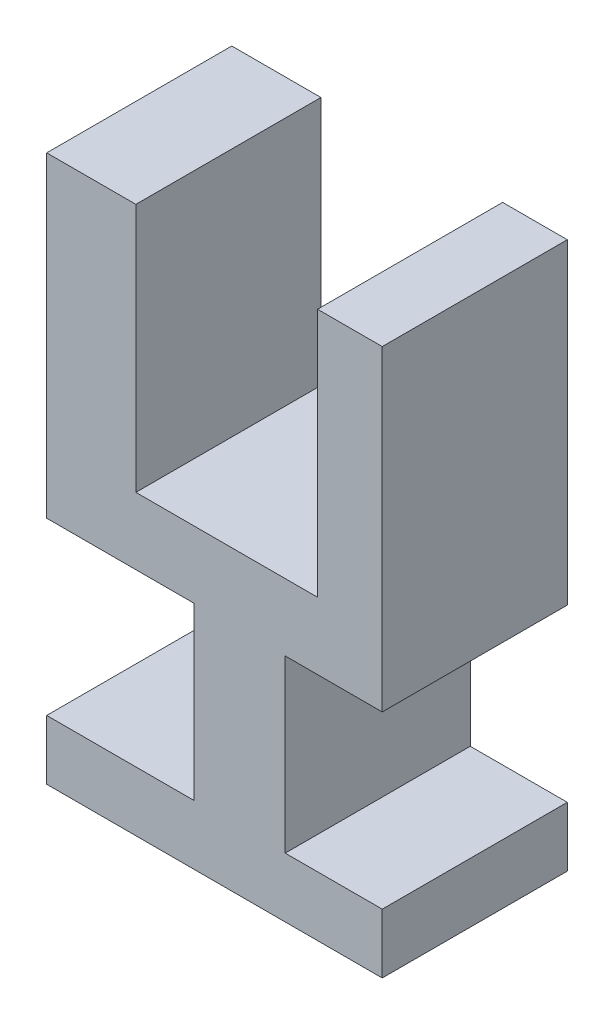
ISO-10303-21;
HEADER;
FILE_DESCRIPTION(('STEP AP214'),'2;1');
FILE_NAME('part.step','',(''),(''),'','','');
FILE_SCHEMA(('AUTOMOTIVE_DESIGN { 1 0 10303 214 1 1 1 1 }'));
ENDSEC;
DATA;
#1=APPLICATION_CONTEXT('core data for automotive mechanical design processes');
#2=APPLICATION_PROTOCOL_DEFINITION('international standard','automotive_design',2000,#1);
#3=PRODUCT_CONTEXT('',#1,'mechanical');
#4=PRODUCT('Part','Part','',(#3));
#5=PRODUCT_RELATED_PRODUCT_CATEGORY('part','',(#4));
#6=PRODUCT_DEFINITION_FORMATION('','',#4);
#7=PRODUCT_DEFINITION_CONTEXT('part definition',#1,'design');
#8=PRODUCT_DEFINITION('design','',#6,#7);
#9=PRODUCT_DEFINITION_SHAPE('','',#8);
#10=(LENGTH_UNIT() NAMED_UNIT(*) SI_UNIT(.MILLI.,.METRE.));
#11=(NAMED_UNIT(*) PLANE_ANGLE_UNIT() SI_UNIT($,.RADIAN.));
#12=(NAMED_UNIT(*) SI_UNIT($,.STERADIAN.) SOLID_ANGLE_UNIT());
#13=UNCERTAINTY_MEASURE_WITH_UNIT(LENGTH_MEASURE(1.E-05),#10,'distance_accuracy_value','');
#14=(GEOMETRIC_REPRESENTATION_CONTEXT(3) GLOBAL_UNCERTAINTY_ASSIGNED_CONTEXT((#13)) GLOBAL_UNIT_ASSIGNED_CONTEXT((#10,
#11,#12)) REPRESENTATION_CONTEXT('',''));
#15=CARTESIAN_POINT('',(0.,0.,0.));
#16=DIRECTION('',(0.,0.,1.));
#17=DIRECTION('',(1.,0.,0.));
#18=AXIS2_PLACEMENT_3D('',#15,#16,#17);
#19=CARTESIAN_POINT('',(-73.184903339249,41.4597692759287,44.));
#20=DIRECTION('',(0.,-1.,0.));
#21=DIRECTION('',(0.,0.,-1.));
#22=AXIS2_PLACEMENT_3D('',#19,#20,#21);
#23=PLANE('',#22);
#24=DIRECTION('',(-1.,0.,0.));
#25=VECTOR('',#24,1.);
#26=CARTESIAN_POINT('',(-73.184903339249,41.4597692759287,0.));
#27=LINE('',#26,#25);
#28=CARTESIAN_POINT('',(-51.9848762665066,41.4597692759287,0.));
#29=VERTEX_POINT('',#28);
#30=CARTESIAN_POINT('',(-73.184903339249,41.4597692759287,0.));
#31=VERTEX_POINT('',#30);
#32=EDGE_CURVE('E177',#29,#31,#27,.T.);
#33=ORIENTED_EDGE('',*,*,#32,.T.);
#34=DIRECTION('',(0.,0.,-1.));
#35=VECTOR('',#34,1.);
#36=CARTESIAN_POINT('',(-73.184903339249,41.4597692759287,44.));
#37=LINE('',#36,#35);
#38=CARTESIAN_POINT('',(-73.184903339249,41.4597692759287,44.));
#39=VERTEX_POINT('',#38);
#40=EDGE_CURVE('E11',#39,#31,#37,.T.);
#41=ORIENTED_EDGE('',*,*,#40,.F.);
#42=DIRECTION('',(-1.,0.,0.));
#43=VECTOR('',#42,1.);
#44=CARTESIAN_POINT('',(-73.184903339249,41.4597692759287,44.));
#45=LINE('',#44,#43);
#46=CARTESIAN_POINT('',(-51.9848762665066,41.4597692759287,44.));
#47=VERTEX_POINT('',#46);
#48=EDGE_CURVE('E207',#47,#39,#45,.T.);
#49=ORIENTED_EDGE('',*,*,#48,.F.);
#50=DIRECTION('',(0.,0.,-1.));
#51=VECTOR('',#50,1.);
#52=CARTESIAN_POINT('',(-51.9848762665066,41.4597692759287,44.));
#53=LINE('',#52,#51);
#54=EDGE_CURVE('E173',#47,#29,#53,.T.);
#55=ORIENTED_EDGE('',*,*,#54,.T.);
#56=EDGE_LOOP('',(#33,#41,#49,#55));
#57=FACE_BOUND('',#56,.T.);
#58=ADVANCED_FACE('F33',(#57),#23,.F.);
#59=CARTESIAN_POINT('',(-73.184903339249,-33.7718650393327,44.));
#60=DIRECTION('',(1.,0.,0.));
#61=DIRECTION('',(0.,0.,-1.));
#62=AXIS2_PLACEMENT_3D('',#59,#60,#61);
#63=PLANE('',#62);
#64=DIRECTION('',(0.,-1.,0.));
#65=VECTOR('',#64,1.);
#66=CARTESIAN_POINT('',(-73.184903339249,-33.7718650393327,0.));
#67=LINE('',#66,#65);
#68=CARTESIAN_POINT('',(-73.184903339249,-33.7718650393327,0.));
#69=VERTEX_POINT('',#68);
#70=EDGE_CURVE('E180',#31,#69,#67,.T.);
#71=ORIENTED_EDGE('',*,*,#70,.T.);
#72=DIRECTION('',(0.,0.,-1.));
#73=VECTOR('',#72,1.);
#74=CARTESIAN_POINT('',(-73.184903339249,-33.7718650393327,44.));
#75=LINE('',#74,#73);
#76=CARTESIAN_POINT('',(-73.184903339249,-33.7718650393327,44.));
#77=VERTEX_POINT('',#76);
#78=EDGE_CURVE('E41',#77,#69,#75,.T.);
#79=ORIENTED_EDGE('',*,*,#78,.F.);
#80=DIRECTION('',(0.,-1.,0.));
#81=VECTOR('',#80,1.);
#82=CARTESIAN_POINT('',(-73.184903339249,-33.7718650393327,44.));
#83=LINE('',#82,#81);
#84=EDGE_CURVE('E116',#39,#77,#83,.T.);
#85=ORIENTED_EDGE('',*,*,#84,.F.);
#86=ORIENTED_EDGE('',*,*,#40,.T.);
#87=EDGE_LOOP('',(#71,#79,#85,#86));
#88=FACE_BOUND('',#87,.T.);
#89=ADVANCED_FACE('F305',(#88),#63,.F.);
#90=CARTESIAN_POINT('',(-38.2157812042546,-33.7718650393327,44.));
#91=DIRECTION('',(0.,1.,0.));
#92=DIRECTION('',(0.,0.,1.));
#93=AXIS2_PLACEMENT_3D('',#90,#91,#92);
#94=PLANE('',#93);
#95=DIRECTION('',(1.,0.,0.));
#96=VECTOR('',#95,1.);
#97=CARTESIAN_POINT('',(-38.2157812042546,-33.7718650393327,0.));
#98=LINE('',#97,#96);
#99=CARTESIAN_POINT('',(-38.2157812042546,-33.7718650393327,0.));
#100=VERTEX_POINT('',#99);
#101=EDGE_CURVE('E182',#69,#100,#98,.T.);
#102=ORIENTED_EDGE('',*,*,#101,.T.);
#103=DIRECTION('',(0.,0.,-1.));
#104=VECTOR('',#103,1.);
#105=CARTESIAN_POINT('',(-38.2157812042546,-33.7718650393327,44.));
#106=LINE('',#105,#104);
#107=CARTESIAN_POINT('',(-38.2157812042546,-33.7718650393327,44.));
#108=VERTEX_POINT('',#107);
#109=EDGE_CURVE('E238',#108,#100,#106,.T.);
#110=ORIENTED_EDGE('',*,*,#109,.F.);
#111=DIRECTION('',(1.,0.,0.));
#112=VECTOR('',#111,1.);
#113=CARTESIAN_POINT('',(-38.2157812042546,-33.7718650393327,44.));
#114=LINE('',#113,#112);
#115=EDGE_CURVE('E246',#77,#108,#114,.T.);
#116=ORIENTED_EDGE('',*,*,#115,.F.);
#117=ORIENTED_EDGE('',*,*,#78,.T.);
#118=EDGE_LOOP('',(#102,#110,#116,#117));
#119=FACE_BOUND('',#118,.T.);
#120=ADVANCED_FACE('F244',(#119),#94,.F.);
#121=CARTESIAN_POINT('',(-38.2157812042546,-74.3741177888072,44.));
#122=DIRECTION('',(1.,0.,0.));
#123=DIRECTION('',(0.,0.,-1.));
#124=AXIS2_PLACEMENT_3D('',#121,#122,#123);
#125=PLANE('',#124);
#126=DIRECTION('',(0.,-1.,0.));
#127=VECTOR('',#126,1.);
#128=CARTESIAN_POINT('',(-38.2157812042546,-74.3741177888072,0.));
#129=LINE('',#128,#127);
#130=CARTESIAN_POINT('',(-38.2157812042546,-74.3741177888072,0.));
#131=VERTEX_POINT('',#130);
#132=EDGE_CURVE('E184',#100,#131,#129,.T.);
#133=ORIENTED_EDGE('',*,*,#132,.T.);
#134=DIRECTION('',(0.,0.,-1.));
#135=VECTOR('',#134,1.);
#136=CARTESIAN_POINT('',(-38.2157812042546,-74.3741177888072,44.));
#137=LINE('',#136,#135);
#138=CARTESIAN_POINT('',(-38.2157812042546,-74.3741177888072,44.));
#139=VERTEX_POINT('',#138);
#140=EDGE_CURVE('E235',#139,#131,#137,.T.);
#141=ORIENTED_EDGE('',*,*,#140,.F.);
#142=DIRECTION('',(0.,-1.,0.));
#143=VECTOR('',#142,1.);
#144=CARTESIAN_POINT('',(-38.2157812042546,-74.3741177888072,44.));
#145=LINE('',#144,#143);
#146=EDGE_CURVE('E264',#108,#139,#145,.T.);
#147=ORIENTED_EDGE('',*,*,#146,.F.);
#148=ORIENTED_EDGE('',*,*,#109,.T.);
#149=EDGE_LOOP('',(#133,#141,#147,#148));
#150=FACE_BOUND('',#149,.T.);
#151=ADVANCED_FACE('F255',(#150),#125,.F.);
#152=CARTESIAN_POINT('',(-73.184903339249,-74.3741177888072,44.));
#153=DIRECTION('',(0.,-1.,0.));
#154=DIRECTION('',(0.,0.,-1.));
#155=AXIS2_PLACEMENT_3D('',#152,#153,#154);
#156=PLANE('',#155);
#157=DIRECTION('',(-1.,0.,0.));
#158=VECTOR('',#157,1.);
#159=CARTESIAN_POINT('',(-73.184903339249,-74.3741177888072,0.));
#160=LINE('',#159,#158);
#161=CARTESIAN_POINT('',(-73.184903339249,-74.3741177888072,0.));
#162=VERTEX_POINT('',#161);
#163=EDGE_CURVE('E186',#131,#162,#160,.T.);
#164=ORIENTED_EDGE('',*,*,#163,.T.);
#165=DIRECTION('',(0.,0.,-1.));
#166=VECTOR('',#165,1.);
#167=CARTESIAN_POINT('',(-73.184903339249,-74.3741177888072,44.));
#168=LINE('',#167,#166);
#169=CARTESIAN_POINT('',(-73.184903339249,-74.3741177888072,44.));
#170=VERTEX_POINT('',#169);
#171=EDGE_CURVE('E232',#170,#162,#168,.T.);
#172=ORIENTED_EDGE('',*,*,#171,.F.);
#173=DIRECTION('',(-1.,0.,0.));
#174=VECTOR('',#173,1.);
#175=CARTESIAN_POINT('',(-73.184903339249,-74.3741177888072,44.));
#176=LINE('',#175,#174);
#177=EDGE_CURVE('E261',#139,#170,#176,.T.);
#178=ORIENTED_EDGE('',*,*,#177,.F.);
#179=ORIENTED_EDGE('',*,*,#140,.T.);
#180=EDGE_LOOP('',(#164,#172,#178,#179));
#181=FACE_BOUND('',#180,.T.);
#182=ADVANCED_FACE('F259',(#181),#156,.F.);
#183=CARTESIAN_POINT('',(-73.184903339249,-88.5507889246157,44.));
#184=DIRECTION('',(1.,0.,0.));
#185=DIRECTION('',(0.,0.,-1.));
#186=AXIS2_PLACEMENT_3D('',#183,#184,#185);
#187=PLANE('',#186);
#188=DIRECTION('',(0.,-1.,0.));
#189=VECTOR('',#188,1.);
#190=CARTESIAN_POINT('',(-73.184903339249,-88.5507889246157,0.));
#191=LINE('',#190,#189);
#192=CARTESIAN_POINT('',(-73.184903339249,-88.5507889246157,0.));
#193=VERTEX_POINT('',#192);
#194=EDGE_CURVE('E188',#162,#193,#191,.T.);
#195=ORIENTED_EDGE('',*,*,#194,.T.);
#196=DIRECTION('',(0.,0.,-1.));
#197=VECTOR('',#196,1.);
#198=CARTESIAN_POINT('',(-73.184903339249,-88.5507889246157,44.));
#199=LINE('',#198,#197);
#200=CARTESIAN_POINT('',(-73.184903339249,-88.5507889246157,44.));
#201=VERTEX_POINT('',#200);
#202=EDGE_CURVE('E229',#201,#193,#199,.T.);
#203=ORIENTED_EDGE('',*,*,#202,.F.);
#204=DIRECTION('',(0.,-1.,0.));
#205=VECTOR('',#204,1.);
#206=CARTESIAN_POINT('',(-73.184903339249,-88.5507889246157,44.));
#207=LINE('',#206,#205);
#208=EDGE_CURVE('E263',#170,#201,#207,.T.);
#209=ORIENTED_EDGE('',*,*,#208,.F.);
#210=ORIENTED_EDGE('',*,*,#171,.T.);
#211=EDGE_LOOP('',(#195,#203,#209,#210));
#212=FACE_BOUND('',#211,.T.);
#213=ADVANCED_FACE('F318',(#212),#187,.F.);
#214=CARTESIAN_POINT('',(6.58963220279662,-88.5507889246157,44.));
#215=DIRECTION('',(0.,1.,0.));
#216=DIRECTION('',(0.,0.,1.));
#217=AXIS2_PLACEMENT_3D('',#214,#215,#216);
#218=PLANE('',#217);
#219=DIRECTION('',(1.,0.,0.));
#220=VECTOR('',#219,1.);
#221=CARTESIAN_POINT('',(6.58963220279662,-88.5507889246157,0.));
#222=LINE('',#221,#220);
#223=CARTESIAN_POINT('',(6.58963220279662,-88.5507889246157,0.));
#224=VERTEX_POINT('',#223);
#225=EDGE_CURVE('E190',#193,#224,#222,.T.);
#226=ORIENTED_EDGE('',*,*,#225,.T.);
#227=DIRECTION('',(0.,0.,-1.));
#228=VECTOR('',#227,1.);
#229=CARTESIAN_POINT('',(6.58963220279662,-88.5507889246157,44.));
#230=LINE('',#229,#228);
#231=CARTESIAN_POINT('',(6.58963220279662,-88.5507889246157,44.));
#232=VERTEX_POINT('',#231);
#233=EDGE_CURVE('E226',#232,#224,#230,.T.);
#234=ORIENTED_EDGE('',*,*,#233,.F.);
#235=DIRECTION('',(1.,0.,0.));
#236=VECTOR('',#235,1.);
#237=CARTESIAN_POINT('',(6.58963220279662,-88.5507889246157,44.));
#238=LINE('',#237,#236);
#239=EDGE_CURVE('E266',#201,#232,#238,.T.);
#240=ORIENTED_EDGE('',*,*,#239,.F.);
#241=ORIENTED_EDGE('',*,*,#202,.T.);
#242=EDGE_LOOP('',(#226,#234,#240,#241));
#243=FACE_BOUND('',#242,.T.);
#244=ADVANCED_FACE('F321',(#243),#218,.F.);
#245=CARTESIAN_POINT('',(6.58963220279662,-74.3741177888072,44.));
#246=DIRECTION('',(-1.,0.,0.));
#247=DIRECTION('',(0.,0.,1.));
#248=AXIS2_PLACEMENT_3D('',#245,#246,#247);
#249=PLANE('',#248);
#250=DIRECTION('',(0.,1.,0.));
#251=VECTOR('',#250,1.);
#252=CARTESIAN_POINT('',(6.58963220279662,-74.3741177888072,0.));
#253=LINE('',#252,#251);
#254=CARTESIAN_POINT('',(6.58963220279662,-74.3741177888072,0.));
#255=VERTEX_POINT('',#254);
#256=EDGE_CURVE('E192',#224,#255,#253,.T.);
#257=ORIENTED_EDGE('',*,*,#256,.T.);
#258=DIRECTION('',(0.,0.,-1.));
#259=VECTOR('',#258,1.);
#260=CARTESIAN_POINT('',(6.58963220279662,-74.3741177888072,44.));
#261=LINE('',#260,#259);
#262=CARTESIAN_POINT('',(6.58963220279662,-74.3741177888072,44.));
#263=VERTEX_POINT('',#262);
#264=EDGE_CURVE('E223',#263,#255,#261,.T.);
#265=ORIENTED_EDGE('',*,*,#264,.F.);
#266=DIRECTION('',(0.,1.,0.));
#267=VECTOR('',#266,1.);
#268=CARTESIAN_POINT('',(6.58963220279662,-74.3741177888072,44.));
#269=LINE('',#268,#267);
#270=EDGE_CURVE('E272',#232,#263,#269,.T.);
#271=ORIENTED_EDGE('',*,*,#270,.F.);
#272=ORIENTED_EDGE('',*,*,#233,.T.);
#273=EDGE_LOOP('',(#257,#265,#271,#272));
#274=FACE_BOUND('',#273,.T.);
#275=ADVANCED_FACE('F325',(#274),#249,.F.);
#276=CARTESIAN_POINT('',(-16.4782187960149,-74.3741177888072,44.));
#277=DIRECTION('',(0.,-1.,0.));
#278=DIRECTION('',(0.,0.,-1.));
#279=AXIS2_PLACEMENT_3D('',#276,#277,#278);
#280=PLANE('',#279);
#281=DIRECTION('',(-1.,0.,0.));
#282=VECTOR('',#281,1.);
#283=CARTESIAN_POINT('',(-16.4782187960149,-74.3741177888072,0.));
#284=LINE('',#283,#282);
#285=CARTESIAN_POINT('',(-16.4782187960149,-74.3741177888072,0.));
#286=VERTEX_POINT('',#285);
#287=EDGE_CURVE('E194',#255,#286,#284,.T.);
#288=ORIENTED_EDGE('',*,*,#287,.T.);
#289=DIRECTION('',(0.,0.,-1.));
#290=VECTOR('',#289,1.);
#291=CARTESIAN_POINT('',(-16.4782187960149,-74.3741177888072,44.));
#292=LINE('',#291,#290);
#293=CARTESIAN_POINT('',(-16.4782187960149,-74.3741177888072,44.));
#294=VERTEX_POINT('',#293);
#295=EDGE_CURVE('E220',#294,#286,#292,.T.);
#296=ORIENTED_EDGE('',*,*,#295,.F.);
#297=DIRECTION('',(-1.,0.,0.));
#298=VECTOR('',#297,1.);
#299=CARTESIAN_POINT('',(-16.4782187960149,-74.3741177888072,44.));
#300=LINE('',#299,#298);
#301=EDGE_CURVE('E274',#263,#294,#300,.T.);
#302=ORIENTED_EDGE('',*,*,#301,.F.);
#303=ORIENTED_EDGE('',*,*,#264,.T.);
#304=EDGE_LOOP('',(#288,#296,#302,#303));
#305=FACE_BOUND('',#304,.T.);
#306=ADVANCED_FACE('F329',(#305),#280,.F.);
#307=CARTESIAN_POINT('',(-16.4782187960149,-33.7718650393327,44.));
#308=DIRECTION('',(-1.,0.,0.));
#309=DIRECTION('',(0.,0.,1.));
#310=AXIS2_PLACEMENT_3D('',#307,#308,#309);
#311=PLANE('',#310);
#312=DIRECTION('',(0.,1.,0.));
#313=VECTOR('',#312,1.);
#314=CARTESIAN_POINT('',(-16.4782187960149,-33.7718650393327,0.));
#315=LINE('',#314,#313);
#316=CARTESIAN_POINT('',(-16.4782187960149,-33.7718650393327,0.));
#317=VERTEX_POINT('',#316);
#318=EDGE_CURVE('E196',#286,#317,#315,.T.);
#319=ORIENTED_EDGE('',*,*,#318,.T.);
#320=DIRECTION('',(0.,0.,-1.));
#321=VECTOR('',#320,1.);
#322=CARTESIAN_POINT('',(-16.4782187960149,-33.7718650393327,44.));
#323=LINE('',#322,#321);
#324=CARTESIAN_POINT('',(-16.4782187960149,-33.7718650393327,44.));
#325=VERTEX_POINT('',#324);
#326=EDGE_CURVE('E217',#325,#317,#323,.T.);
#327=ORIENTED_EDGE('',*,*,#326,.F.);
#328=DIRECTION('',(0.,1.,0.));
#329=VECTOR('',#328,1.);
#330=CARTESIAN_POINT('',(-16.4782187960149,-33.7718650393327,44.));
#331=LINE('',#330,#329);
#332=EDGE_CURVE('E276',#294,#325,#331,.T.);
#333=ORIENTED_EDGE('',*,*,#332,.F.);
#334=ORIENTED_EDGE('',*,*,#295,.T.);
#335=EDGE_LOOP('',(#319,#327,#333,#334));
#336=FACE_BOUND('',#335,.T.);
#337=ADVANCED_FACE('F333',(#336),#311,.F.);
#338=CARTESIAN_POINT('',(6.58963220279662,-33.7718650393327,44.));
#339=DIRECTION('',(0.,1.,0.));
#340=DIRECTION('',(0.,0.,1.));
#341=AXIS2_PLACEMENT_3D('',#338,#339,#340);
#342=PLANE('',#341);
#343=DIRECTION('',(1.,0.,0.));
#344=VECTOR('',#343,1.);
#345=CARTESIAN_POINT('',(6.58963220279662,-33.7718650393327,0.));
#346=LINE('',#345,#344);
#347=CARTESIAN_POINT('',(6.58963220279662,-33.7718650393327,0.));
#348=VERTEX_POINT('',#347);
#349=EDGE_CURVE('E198',#317,#348,#346,.T.);
#350=ORIENTED_EDGE('',*,*,#349,.T.);
#351=DIRECTION('',(0.,0.,-1.));
#352=VECTOR('',#351,1.);
#353=CARTESIAN_POINT('',(6.58963220279662,-33.7718650393327,44.));
#354=LINE('',#353,#352);
#355=CARTESIAN_POINT('',(6.58963220279662,-33.7718650393327,44.));
#356=VERTEX_POINT('',#355);
#357=EDGE_CURVE('E214',#356,#348,#354,.T.);
#358=ORIENTED_EDGE('',*,*,#357,.F.);
#359=DIRECTION('',(1.,0.,0.));
#360=VECTOR('',#359,1.);
#361=CARTESIAN_POINT('',(6.58963220279662,-33.7718650393327,44.));
#362=LINE('',#361,#360);
#363=EDGE_CURVE('E278',#325,#356,#362,.T.);
#364=ORIENTED_EDGE('',*,*,#363,.F.);
#365=ORIENTED_EDGE('',*,*,#326,.T.);
#366=EDGE_LOOP('',(#350,#358,#364,#365));
#367=FACE_BOUND('',#366,.T.);
#368=ADVANCED_FACE('F337',(#367),#342,.F.);
#369=CARTESIAN_POINT('',(6.58963220279662,41.4597692759287,44.));
#370=DIRECTION('',(-1.,0.,0.));
#371=DIRECTION('',(0.,0.,1.));
#372=AXIS2_PLACEMENT_3D('',#369,#370,#371);
#373=PLANE('',#372);
#374=DIRECTION('',(0.,1.,0.));
#375=VECTOR('',#374,1.);
#376=CARTESIAN_POINT('',(6.58963220279662,41.4597692759287,0.));
#377=LINE('',#376,#375);
#378=CARTESIAN_POINT('',(6.58963220279662,41.4597692759287,0.));
#379=VERTEX_POINT('',#378);
#380=EDGE_CURVE('E200',#348,#379,#377,.T.);
#381=ORIENTED_EDGE('',*,*,#380,.T.);
#382=DIRECTION('',(0.,0.,-1.));
#383=VECTOR('',#382,1.);
#384=CARTESIAN_POINT('',(6.58963220279662,41.4597692759287,44.));
#385=LINE('',#384,#383);
#386=CARTESIAN_POINT('',(6.58963220279662,41.4597692759287,44.));
#387=VERTEX_POINT('',#386);
#388=EDGE_CURVE('E211',#387,#379,#385,.T.);
#389=ORIENTED_EDGE('',*,*,#388,.F.);
#390=DIRECTION('',(0.,1.,0.));
#391=VECTOR('',#390,1.);
#392=CARTESIAN_POINT('',(6.58963220279662,41.4597692759287,44.));
#393=LINE('',#392,#391);
#394=EDGE_CURVE('E280',#356,#387,#393,.T.);
#395=ORIENTED_EDGE('',*,*,#394,.F.);
#396=ORIENTED_EDGE('',*,*,#357,.T.);
#397=EDGE_LOOP('',(#381,#389,#395,#396));
#398=FACE_BOUND('',#397,.T.);
#399=ADVANCED_FACE('F286',(#398),#373,.F.);
#400=CARTESIAN_POINT('',(-8.78617627039546,41.4597692759287,44.));
#401=DIRECTION('',(0.,-1.,0.));
#402=DIRECTION('',(0.,0.,-1.));
#403=AXIS2_PLACEMENT_3D('',#400,#401,#402);
#404=PLANE('',#403);
#405=DIRECTION('',(-1.,0.,0.));
#406=VECTOR('',#405,1.);
#407=CARTESIAN_POINT('',(-8.78617627039546,41.4597692759287,0.));
#408=LINE('',#407,#406);
#409=CARTESIAN_POINT('',(-8.78617627039546,41.4597692759287,0.));
#410=VERTEX_POINT('',#409);
#411=EDGE_CURVE('E202',#379,#410,#408,.T.);
#412=ORIENTED_EDGE('',*,*,#411,.T.);
#413=DIRECTION('',(0.,0.,-1.));
#414=VECTOR('',#413,1.);
#415=CARTESIAN_POINT('',(-8.78617627039546,41.4597692759287,44.));
#416=LINE('',#415,#414);
#417=CARTESIAN_POINT('',(-8.78617627039546,41.4597692759287,44.));
#418=VERTEX_POINT('',#417);
#419=EDGE_CURVE('E168',#418,#410,#416,.T.);
#420=ORIENTED_EDGE('',*,*,#419,.F.);
#421=DIRECTION('',(-1.,0.,0.));
#422=VECTOR('',#421,1.);
#423=CARTESIAN_POINT('',(-8.78617627039546,41.4597692759287,44.));
#424=LINE('',#423,#422);
#425=EDGE_CURVE('E159',#387,#418,#424,.T.);
#426=ORIENTED_EDGE('',*,*,#425,.F.);
#427=ORIENTED_EDGE('',*,*,#388,.T.);
#428=EDGE_LOOP('',(#412,#420,#426,#427));
#429=FACE_BOUND('',#428,.T.);
#430=ADVANCED_FACE('F290',(#429),#404,.F.);
#431=CARTESIAN_POINT('',(-8.78617627039546,-17.8469205492408,44.));
#432=DIRECTION('',(1.,0.,0.));
#433=DIRECTION('',(0.,0.,-1.));
#434=AXIS2_PLACEMENT_3D('',#431,#432,#433);
#435=PLANE('',#434);
#436=DIRECTION('',(0.,-1.,0.));
#437=VECTOR('',#436,1.);
#438=CARTESIAN_POINT('',(-8.78617627039546,-17.8469205492408,0.));
#439=LINE('',#438,#437);
#440=CARTESIAN_POINT('',(-8.78617627039546,-17.8469205492408,0.));
#441=VERTEX_POINT('',#440);
#442=EDGE_CURVE('E167',#410,#441,#439,.T.);
#443=ORIENTED_EDGE('',*,*,#442,.T.);
#444=DIRECTION('',(0.,0.,-1.));
#445=VECTOR('',#444,1.);
#446=CARTESIAN_POINT('',(-8.78617627039546,-17.8469205492408,44.));
#447=LINE('',#446,#445);
#448=CARTESIAN_POINT('',(-8.78617627039546,-17.8469205492408,44.));
#449=VERTEX_POINT('',#448);
#450=EDGE_CURVE('E164',#449,#441,#447,.T.);
#451=ORIENTED_EDGE('',*,*,#450,.F.);
#452=DIRECTION('',(0.,-1.,0.));
#453=VECTOR('',#452,1.);
#454=CARTESIAN_POINT('',(-8.78617627039546,-17.8469205492408,44.));
#455=LINE('',#454,#453);
#456=EDGE_CURVE('E153',#418,#449,#455,.T.);
#457=ORIENTED_EDGE('',*,*,#456,.F.);
#458=ORIENTED_EDGE('',*,*,#419,.T.);
#459=EDGE_LOOP('',(#443,#451,#457,#458));
#460=FACE_BOUND('',#459,.T.);
#461=ADVANCED_FACE('F165',(#460),#435,.F.);
#462=CARTESIAN_POINT('',(-51.9848762665066,-17.8469205492408,44.));
#463=DIRECTION('',(0.,-1.,0.));
#464=DIRECTION('',(0.,0.,-1.));
#465=AXIS2_PLACEMENT_3D('',#462,#463,#464);
#466=PLANE('',#465);
#467=DIRECTION('',(-1.,0.,0.));
#468=VECTOR('',#467,1.);
#469=CARTESIAN_POINT('',(-51.9848762665066,-17.8469205492408,0.));
#470=LINE('',#469,#468);
#471=CARTESIAN_POINT('',(-51.9848762665066,-17.8469205492408,0.));
#472=VERTEX_POINT('',#471);
#473=EDGE_CURVE('E102',#441,#472,#470,.T.);
#474=ORIENTED_EDGE('',*,*,#473,.T.);
#475=DIRECTION('',(0.,0.,-1.));
#476=VECTOR('',#475,1.);
#477=CARTESIAN_POINT('',(-51.9848762665066,-17.8469205492408,44.));
#478=LINE('',#477,#476);
#479=CARTESIAN_POINT('',(-51.9848762665066,-17.8469205492408,44.));
#480=VERTEX_POINT('',#479);
#481=EDGE_CURVE('E169',#480,#472,#478,.T.);
#482=ORIENTED_EDGE('',*,*,#481,.F.);
#483=DIRECTION('',(-1.,0.,0.));
#484=VECTOR('',#483,1.);
#485=CARTESIAN_POINT('',(-51.9848762665066,-17.8469205492408,44.));
#486=LINE('',#485,#484);
#487=EDGE_CURVE('E157',#449,#480,#486,.T.);
#488=ORIENTED_EDGE('',*,*,#487,.F.);
#489=ORIENTED_EDGE('',*,*,#450,.T.);
#490=EDGE_LOOP('',(#474,#482,#488,#489));
#491=FACE_BOUND('',#490,.T.);
#492=ADVANCED_FACE('F171',(#491),#466,.F.);
#493=CARTESIAN_POINT('',(-51.9848762665066,41.4597692759287,44.));
#494=DIRECTION('',(-1.,0.,0.));
#495=DIRECTION('',(0.,0.,1.));
#496=AXIS2_PLACEMENT_3D('',#493,#494,#495);
#497=PLANE('',#496);
#498=DIRECTION('',(0.,1.,0.));
#499=VECTOR('',#498,1.);
#500=CARTESIAN_POINT('',(-51.9848762665066,41.4597692759287,0.));
#501=LINE('',#500,#499);
#502=EDGE_CURVE('E108',#472,#29,#501,.T.);
#503=ORIENTED_EDGE('',*,*,#502,.T.);
#504=ORIENTED_EDGE('',*,*,#54,.F.);
#505=DIRECTION('',(0.,1.,0.));
#506=VECTOR('',#505,1.);
#507=CARTESIAN_POINT('',(-51.9848762665066,41.4597692759287,44.));
#508=LINE('',#507,#506);
#509=EDGE_CURVE('E49',#480,#47,#508,.T.);
#510=ORIENTED_EDGE('',*,*,#509,.F.);
#511=ORIENTED_EDGE('',*,*,#481,.T.);
#512=EDGE_LOOP('',(#503,#504,#510,#511));
#513=FACE_BOUND('',#512,.T.);
#514=ADVANCED_FACE('F294',(#513),#497,.F.);
#515=CARTESIAN_POINT('',(0.,0.,44.));
#516=DIRECTION('',(0.,0.,-1.));
#517=DIRECTION('',(-1.,0.,0.));
#518=AXIS2_PLACEMENT_3D('',#515,#516,#517);
#519=PLANE('',#518);
#520=ORIENTED_EDGE('',*,*,#48,.T.);
#521=ORIENTED_EDGE('',*,*,#84,.T.);
#522=ORIENTED_EDGE('',*,*,#115,.T.);
#523=ORIENTED_EDGE('',*,*,#146,.T.);
#524=ORIENTED_EDGE('',*,*,#177,.T.);
#525=ORIENTED_EDGE('',*,*,#208,.T.);
#526=ORIENTED_EDGE('',*,*,#239,.T.);
#527=ORIENTED_EDGE('',*,*,#270,.T.);
#528=ORIENTED_EDGE('',*,*,#301,.T.);
#529=ORIENTED_EDGE('',*,*,#332,.T.);
#530=ORIENTED_EDGE('',*,*,#363,.T.);
#531=ORIENTED_EDGE('',*,*,#394,.T.);
#532=ORIENTED_EDGE('',*,*,#425,.T.);
#533=ORIENTED_EDGE('',*,*,#456,.T.);
#534=ORIENTED_EDGE('',*,*,#487,.T.);
#535=ORIENTED_EDGE('',*,*,#509,.T.);
#536=EDGE_LOOP('',(#520,#521,#522,#523,#524,#525,#526,#527,#528,#529,#530,#531,#532,#533,#534,#535));
#537=FACE_BOUND('',#536,.T.);
#538=ADVANCED_FACE('F155',(#537),#519,.F.);
#539=CARTESIAN_POINT('',(0.,0.,0.));
#540=DIRECTION('',(0.,0.,-1.));
#541=DIRECTION('',(-1.,0.,0.));
#542=AXIS2_PLACEMENT_3D('',#539,#540,#541);
#543=PLANE('',#542);
#544=ORIENTED_EDGE('',*,*,#32,.F.);
#545=ORIENTED_EDGE('',*,*,#502,.F.);
#546=ORIENTED_EDGE('',*,*,#473,.F.);
#547=ORIENTED_EDGE('',*,*,#442,.F.);
#548=ORIENTED_EDGE('',*,*,#411,.F.);
#549=ORIENTED_EDGE('',*,*,#380,.F.);
#550=ORIENTED_EDGE('',*,*,#349,.F.);
#551=ORIENTED_EDGE('',*,*,#318,.F.);
#552=ORIENTED_EDGE('',*,*,#287,.F.);
#553=ORIENTED_EDGE('',*,*,#256,.F.);
#554=ORIENTED_EDGE('',*,*,#225,.F.);
#555=ORIENTED_EDGE('',*,*,#194,.F.);
#556=ORIENTED_EDGE('',*,*,#163,.F.);
#557=ORIENTED_EDGE('',*,*,#132,.F.);
#558=ORIENTED_EDGE('',*,*,#101,.F.);
#559=ORIENTED_EDGE('',*,*,#70,.F.);
#560=EDGE_LOOP('',(#544,#545,#546,#547,#548,#549,#550,#551,#552,#553,#554,#555,#556,#557,#558,#559));
#561=FACE_BOUND('',#560,.T.);
#562=ADVANCED_FACE('F250',(#561),#543,.T.);
#563=CLOSED_SHELL('',(#58,#89,#120,#151,#182,#213,#244,#275,#306,#337,#368,#399,#430,#461,#492,
#514,#538,#562));
#564=MANIFOLD_SOLID_BREP('B2',#563);
#565=ADVANCED_BREP_SHAPE_REPRESENTATION('',(#18,#564),#14);
#566=SHAPE_DEFINITION_REPRESENTATION(#9,#565);
ENDSEC;
END-ISO-10303-21;
